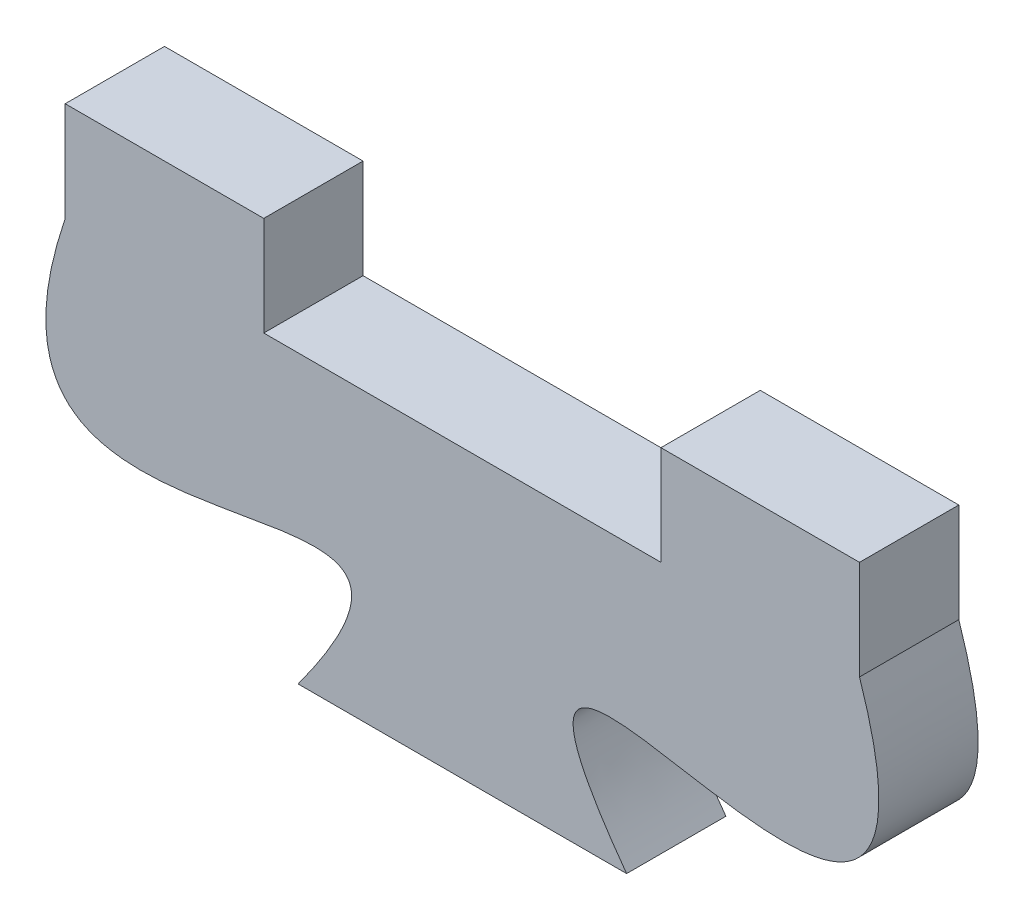
ISO-10303-21;
HEADER;
FILE_DESCRIPTION(('STEP AP214'),'2;1');
FILE_NAME('part.step','',(''),(''),'','','');
FILE_SCHEMA(('AUTOMOTIVE_DESIGN { 1 0 10303 214 1 1 1 1 }'));
ENDSEC;
DATA;
#1=APPLICATION_CONTEXT('core data for automotive mechanical design processes');
#2=APPLICATION_PROTOCOL_DEFINITION('international standard','automotive_design',2000,#1);
#3=PRODUCT_CONTEXT('',#1,'mechanical');
#4=PRODUCT('Part','Part','',(#3));
#5=PRODUCT_RELATED_PRODUCT_CATEGORY('part','',(#4));
#6=PRODUCT_DEFINITION_FORMATION('','',#4);
#7=PRODUCT_DEFINITION_CONTEXT('part definition',#1,'design');
#8=PRODUCT_DEFINITION('design','',#6,#7);
#9=PRODUCT_DEFINITION_SHAPE('','',#8);
#10=(LENGTH_UNIT() NAMED_UNIT(*) SI_UNIT(.MILLI.,.METRE.));
#11=(NAMED_UNIT(*) PLANE_ANGLE_UNIT() SI_UNIT($,.RADIAN.));
#12=(NAMED_UNIT(*) SI_UNIT($,.STERADIAN.) SOLID_ANGLE_UNIT());
#13=UNCERTAINTY_MEASURE_WITH_UNIT(LENGTH_MEASURE(1.E-05),#10,'distance_accuracy_value','');
#14=(GEOMETRIC_REPRESENTATION_CONTEXT(3) GLOBAL_UNCERTAINTY_ASSIGNED_CONTEXT((#13)) GLOBAL_UNIT_ASSIGNED_CONTEXT((#10,
#11,#12)) REPRESENTATION_CONTEXT('',''));
#15=CARTESIAN_POINT('',(0.,0.,0.));
#16=DIRECTION('',(0.,0.,1.));
#17=DIRECTION('',(1.,0.,0.));
#18=AXIS2_PLACEMENT_3D('',#15,#16,#17);
#19=CARTESIAN_POINT('',(-66.5721500795058,0.,3.175));
#20=DIRECTION('',(-1.,0.,0.));
#21=DIRECTION('',(0.,0.,1.));
#22=AXIS2_PLACEMENT_3D('',#19,#20,#21);
#23=PLANE('',#22);
#24=DIRECTION('',(0.,1.,0.));
#25=VECTOR('',#24,1.);
#26=CARTESIAN_POINT('',(-66.5721500795058,0.,0.));
#27=LINE('',#26,#25);
#28=CARTESIAN_POINT('',(-66.5721500795058,32.1944331283129,0.));
#29=VERTEX_POINT('',#28);
#30=CARTESIAN_POINT('',(-66.5721500795058,35.3694331283129,0.));
#31=VERTEX_POINT('',#30);
#32=EDGE_CURVE('E142',#29,#31,#27,.T.);
#33=ORIENTED_EDGE('',*,*,#32,.F.);
#34=DIRECTION('',(0.,0.,-1.));
#35=VECTOR('',#34,1.);
#36=CARTESIAN_POINT('',(-66.5721500795058,32.1944331283129,3.175));
#37=LINE('',#36,#35);
#38=CARTESIAN_POINT('',(-66.5721500795058,32.1944331283129,3.175));
#39=VERTEX_POINT('',#38);
#40=EDGE_CURVE('E11',#39,#29,#37,.T.);
#41=ORIENTED_EDGE('',*,*,#40,.F.);
#42=DIRECTION('',(0.,1.,0.));
#43=VECTOR('',#42,1.);
#44=CARTESIAN_POINT('',(-66.5721500795058,0.,3.175));
#45=LINE('',#44,#43);
#46=CARTESIAN_POINT('',(-66.5721500795058,35.3694331283129,3.175));
#47=VERTEX_POINT('',#46);
#48=EDGE_CURVE('E177',#39,#47,#45,.T.);
#49=ORIENTED_EDGE('',*,*,#48,.T.);
#50=DIRECTION('',(0.,0.,-1.));
#51=VECTOR('',#50,1.);
#52=CARTESIAN_POINT('',(-66.5721500795058,35.3694331283129,3.175));
#53=LINE('',#52,#51);
#54=EDGE_CURVE('E51',#47,#31,#53,.T.);
#55=ORIENTED_EDGE('',*,*,#54,.T.);
#56=EDGE_LOOP('',(#33,#41,#49,#55));
#57=FACE_BOUND('',#56,.T.);
#58=ADVANCED_FACE('F35',(#57),#23,.T.);
#59=CARTESIAN_POINT('',(-66.5721500795058,32.1944331283129,3.175));
#60=CARTESIAN_POINT('',(-70.7961120313766,19.6101925252432,3.175));
#61=CARTESIAN_POINT('',(-51.7665034842543,33.1167018138156,3.175));
#62=CARTESIAN_POINT('',(-59.1245975767005,23.0250331283129,3.175));
#63=B_SPLINE_CURVE_WITH_KNOTS('',3,(#59,#60,#61,#62),.UNSPECIFIED.,.F.,.F.,(4,4),(0.,1.),.UNSPECIFIED.);
#64=DIRECTION('',(0.,0.,-1.));
#65=VECTOR('',#64,1.);
#66=SURFACE_OF_LINEAR_EXTRUSION('',#63,#65);
#67=CARTESIAN_POINT('',(-66.5721500795058,32.1944331283129,0.));
#68=CARTESIAN_POINT('',(-70.7961120313766,19.6101925252432,0.));
#69=CARTESIAN_POINT('',(-51.7665034842543,33.1167018138156,0.));
#70=CARTESIAN_POINT('',(-59.1245975767005,23.0250331283129,0.));
#71=B_SPLINE_CURVE_WITH_KNOTS('',3,(#67,#68,#69,#70),.UNSPECIFIED.,.F.,.F.,(4,4),(0.,1.),.UNSPECIFIED.);
#72=CARTESIAN_POINT('',(-59.1245975767005,23.0250331283129,0.));
#73=VERTEX_POINT('',#72);
#74=EDGE_CURVE('E144',#29,#73,#71,.T.);
#75=ORIENTED_EDGE('',*,*,#74,.T.);
#76=DIRECTION('',(0.,0.,-1.));
#77=VECTOR('',#76,1.);
#78=CARTESIAN_POINT('',(-59.1245975767005,23.0250331283129,3.175));
#79=LINE('',#78,#77);
#80=CARTESIAN_POINT('',(-59.1245975767005,23.0250331283129,3.175));
#81=VERTEX_POINT('',#80);
#82=EDGE_CURVE('E43',#81,#73,#79,.T.);
#83=ORIENTED_EDGE('',*,*,#82,.F.);
#84=EDGE_CURVE('E210',#39,#81,#63,.T.);
#85=ORIENTED_EDGE('',*,*,#84,.F.);
#86=ORIENTED_EDGE('',*,*,#40,.T.);
#87=EDGE_LOOP('',(#75,#83,#85,#86));
#88=FACE_BOUND('',#87,.T.);
#89=ADVANCED_FACE('F198',(#88),#66,.F.);
#90=CARTESIAN_POINT('',(0.,23.0250331283129,3.175));
#91=DIRECTION('',(0.,-1.,0.));
#92=DIRECTION('',(0.,0.,-1.));
#93=AXIS2_PLACEMENT_3D('',#90,#91,#92);
#94=PLANE('',#93);
#95=DIRECTION('',(-1.,0.,0.));
#96=VECTOR('',#95,1.);
#97=CARTESIAN_POINT('',(0.,23.0250331283129,0.));
#98=LINE('',#97,#96);
#99=CARTESIAN_POINT('',(-48.6197025823112,23.0250331283129,0.));
#100=VERTEX_POINT('',#99);
#101=EDGE_CURVE('E149',#100,#73,#98,.T.);
#102=ORIENTED_EDGE('',*,*,#101,.F.);
#103=DIRECTION('',(0.,0.,-1.));
#104=VECTOR('',#103,1.);
#105=CARTESIAN_POINT('',(-48.6197025823112,23.0250331283129,3.175));
#106=LINE('',#105,#104);
#107=CARTESIAN_POINT('',(-48.6197025823112,23.0250331283129,3.175));
#108=VERTEX_POINT('',#107);
#109=EDGE_CURVE('E188',#108,#100,#106,.T.);
#110=ORIENTED_EDGE('',*,*,#109,.F.);
#111=DIRECTION('',(-1.,0.,0.));
#112=VECTOR('',#111,1.);
#113=CARTESIAN_POINT('',(0.,23.0250331283129,3.175));
#114=LINE('',#113,#112);
#115=EDGE_CURVE('E195',#108,#81,#114,.T.);
#116=ORIENTED_EDGE('',*,*,#115,.T.);
#117=ORIENTED_EDGE('',*,*,#82,.T.);
#118=EDGE_LOOP('',(#102,#110,#116,#117));
#119=FACE_BOUND('',#118,.T.);
#120=ADVANCED_FACE('F193',(#119),#94,.T.);
#121=CARTESIAN_POINT('',(-41.1721500795058,32.1944331283129,3.175));
#122=CARTESIAN_POINT('',(-36.9481881276352,19.6101925252431,3.175));
#123=CARTESIAN_POINT('',(-55.9777966747574,33.1167018138157,3.175));
#124=CARTESIAN_POINT('',(-48.6197025823112,23.0250331283129,3.175));
#125=B_SPLINE_CURVE_WITH_KNOTS('',3,(#121,#122,#123,#124),.UNSPECIFIED.,.F.,.F.,(4,4),(0.,1.),.UNSPECIFIED.);
#126=DIRECTION('',(0.,0.,-1.));
#127=VECTOR('',#126,1.);
#128=SURFACE_OF_LINEAR_EXTRUSION('',#125,#127);
#129=CARTESIAN_POINT('',(-41.1721500795058,32.1944331283129,0.));
#130=CARTESIAN_POINT('',(-36.9481881276352,19.6101925252431,0.));
#131=CARTESIAN_POINT('',(-55.9777966747574,33.1167018138157,0.));
#132=CARTESIAN_POINT('',(-48.6197025823112,23.0250331283129,0.));
#133=B_SPLINE_CURVE_WITH_KNOTS('',3,(#129,#130,#131,#132),.UNSPECIFIED.,.F.,.F.,(4,4),(0.,1.),.UNSPECIFIED.);
#134=CARTESIAN_POINT('',(-41.1721500795058,32.1944331283129,0.));
#135=VERTEX_POINT('',#134);
#136=EDGE_CURVE('E155',#135,#100,#133,.T.);
#137=ORIENTED_EDGE('',*,*,#136,.F.);
#138=DIRECTION('',(0.,0.,-1.));
#139=VECTOR('',#138,1.);
#140=CARTESIAN_POINT('',(-41.1721500795058,32.1944331283129,3.175));
#141=LINE('',#140,#139);
#142=CARTESIAN_POINT('',(-41.1721500795058,32.1944331283129,3.175));
#143=VERTEX_POINT('',#142);
#144=EDGE_CURVE('E186',#143,#135,#141,.T.);
#145=ORIENTED_EDGE('',*,*,#144,.F.);
#146=EDGE_CURVE('E209',#143,#108,#125,.T.);
#147=ORIENTED_EDGE('',*,*,#146,.T.);
#148=ORIENTED_EDGE('',*,*,#109,.T.);
#149=EDGE_LOOP('',(#137,#145,#147,#148));
#150=FACE_BOUND('',#149,.T.);
#151=ADVANCED_FACE('F205',(#150),#128,.T.);
#152=CARTESIAN_POINT('',(-41.1721500795058,0.,3.175));
#153=DIRECTION('',(-1.,0.,0.));
#154=DIRECTION('',(0.,0.,1.));
#155=AXIS2_PLACEMENT_3D('',#152,#153,#154);
#156=PLANE('',#155);
#157=DIRECTION('',(0.,1.,0.));
#158=VECTOR('',#157,1.);
#159=CARTESIAN_POINT('',(-41.1721500795058,0.,0.));
#160=LINE('',#159,#158);
#161=CARTESIAN_POINT('',(-41.1721500795058,35.3694331283129,0.));
#162=VERTEX_POINT('',#161);
#163=EDGE_CURVE('E160',#135,#162,#160,.T.);
#164=ORIENTED_EDGE('',*,*,#163,.T.);
#165=DIRECTION('',(0.,0.,-1.));
#166=VECTOR('',#165,1.);
#167=CARTESIAN_POINT('',(-41.1721500795058,35.3694331283129,3.175));
#168=LINE('',#167,#166);
#169=CARTESIAN_POINT('',(-41.1721500795058,35.3694331283129,3.175));
#170=VERTEX_POINT('',#169);
#171=EDGE_CURVE('E183',#170,#162,#168,.T.);
#172=ORIENTED_EDGE('',*,*,#171,.F.);
#173=DIRECTION('',(0.,1.,0.));
#174=VECTOR('',#173,1.);
#175=CARTESIAN_POINT('',(-41.1721500795058,0.,3.175));
#176=LINE('',#175,#174);
#177=EDGE_CURVE('E212',#143,#170,#176,.T.);
#178=ORIENTED_EDGE('',*,*,#177,.F.);
#179=ORIENTED_EDGE('',*,*,#144,.T.);
#180=EDGE_LOOP('',(#164,#172,#178,#179));
#181=FACE_BOUND('',#180,.T.);
#182=ADVANCED_FACE('F230',(#181),#156,.F.);
#183=CARTESIAN_POINT('',(0.,35.3694331283129,3.175));
#184=DIRECTION('',(0.,-1.,0.));
#185=DIRECTION('',(0.,0.,-1.));
#186=AXIS2_PLACEMENT_3D('',#183,#184,#185);
#187=PLANE('',#186);
#188=DIRECTION('',(-1.,0.,0.));
#189=VECTOR('',#188,1.);
#190=CARTESIAN_POINT('',(0.,35.3694331283129,0.));
#191=LINE('',#190,#189);
#192=CARTESIAN_POINT('',(-47.5221500795058,35.3694331283129,0.));
#193=VERTEX_POINT('',#192);
#194=EDGE_CURVE('E165',#162,#193,#191,.T.);
#195=ORIENTED_EDGE('',*,*,#194,.T.);
#196=DIRECTION('',(0.,0.,-1.));
#197=VECTOR('',#196,1.);
#198=CARTESIAN_POINT('',(-47.5221500795058,35.3694331283129,3.175));
#199=LINE('',#198,#197);
#200=CARTESIAN_POINT('',(-47.5221500795058,35.3694331283129,3.175));
#201=VERTEX_POINT('',#200);
#202=EDGE_CURVE('E181',#201,#193,#199,.T.);
#203=ORIENTED_EDGE('',*,*,#202,.F.);
#204=DIRECTION('',(-1.,0.,0.));
#205=VECTOR('',#204,1.);
#206=CARTESIAN_POINT('',(0.,35.3694331283129,3.175));
#207=LINE('',#206,#205);
#208=EDGE_CURVE('E137',#170,#201,#207,.T.);
#209=ORIENTED_EDGE('',*,*,#208,.F.);
#210=ORIENTED_EDGE('',*,*,#171,.T.);
#211=EDGE_LOOP('',(#195,#203,#209,#210));
#212=FACE_BOUND('',#211,.T.);
#213=ADVANCED_FACE('F254',(#212),#187,.F.);
#214=CARTESIAN_POINT('',(-47.5221500795058,0.,3.175));
#215=DIRECTION('',(-1.,0.,0.));
#216=DIRECTION('',(0.,0.,1.));
#217=AXIS2_PLACEMENT_3D('',#214,#215,#216);
#218=PLANE('',#217);
#219=DIRECTION('',(0.,1.,0.));
#220=VECTOR('',#219,1.);
#221=CARTESIAN_POINT('',(-47.5221500795058,0.,0.));
#222=LINE('',#221,#220);
#223=CARTESIAN_POINT('',(-47.5221500795058,32.1944331283129,0.));
#224=VERTEX_POINT('',#223);
#225=EDGE_CURVE('E168',#224,#193,#222,.T.);
#226=ORIENTED_EDGE('',*,*,#225,.F.);
#227=DIRECTION('',(0.,0.,-1.));
#228=VECTOR('',#227,1.);
#229=CARTESIAN_POINT('',(-47.5221500795058,32.1944331283129,3.175));
#230=LINE('',#229,#228);
#231=CARTESIAN_POINT('',(-47.5221500795058,32.1944331283129,3.175));
#232=VERTEX_POINT('',#231);
#233=EDGE_CURVE('E123',#232,#224,#230,.T.);
#234=ORIENTED_EDGE('',*,*,#233,.F.);
#235=DIRECTION('',(0.,1.,0.));
#236=VECTOR('',#235,1.);
#237=CARTESIAN_POINT('',(-47.5221500795058,0.,3.175));
#238=LINE('',#237,#236);
#239=EDGE_CURVE('E135',#232,#201,#238,.T.);
#240=ORIENTED_EDGE('',*,*,#239,.T.);
#241=ORIENTED_EDGE('',*,*,#202,.T.);
#242=EDGE_LOOP('',(#226,#234,#240,#241));
#243=FACE_BOUND('',#242,.T.);
#244=ADVANCED_FACE('F252',(#243),#218,.T.);
#245=CARTESIAN_POINT('',(0.,32.1944331283129,3.175));
#246=DIRECTION('',(0.,1.,0.));
#247=DIRECTION('',(0.,0.,1.));
#248=AXIS2_PLACEMENT_3D('',#245,#246,#247);
#249=PLANE('',#248);
#250=DIRECTION('',(1.,0.,0.));
#251=VECTOR('',#250,1.);
#252=CARTESIAN_POINT('',(0.,32.1944331283129,0.));
#253=LINE('',#252,#251);
#254=CARTESIAN_POINT('',(-60.2221500795058,32.1944331283129,0.));
#255=VERTEX_POINT('',#254);
#256=EDGE_CURVE('E120',#255,#224,#253,.T.);
#257=ORIENTED_EDGE('',*,*,#256,.F.);
#258=DIRECTION('',(0.,0.,-1.));
#259=VECTOR('',#258,1.);
#260=CARTESIAN_POINT('',(-60.2221500795058,32.1944331283129,3.175));
#261=LINE('',#260,#259);
#262=CARTESIAN_POINT('',(-60.2221500795058,32.1944331283129,3.175));
#263=VERTEX_POINT('',#262);
#264=EDGE_CURVE('E114',#263,#255,#261,.T.);
#265=ORIENTED_EDGE('',*,*,#264,.F.);
#266=DIRECTION('',(1.,0.,0.));
#267=VECTOR('',#266,1.);
#268=CARTESIAN_POINT('',(0.,32.1944331283129,3.175));
#269=LINE('',#268,#267);
#270=EDGE_CURVE('E118',#263,#232,#269,.T.);
#271=ORIENTED_EDGE('',*,*,#270,.T.);
#272=ORIENTED_EDGE('',*,*,#233,.T.);
#273=EDGE_LOOP('',(#257,#265,#271,#272));
#274=FACE_BOUND('',#273,.T.);
#275=ADVANCED_FACE('F116',(#274),#249,.T.);
#276=CARTESIAN_POINT('',(-60.2221500795058,0.,3.175));
#277=DIRECTION('',(-1.,0.,0.));
#278=DIRECTION('',(0.,0.,1.));
#279=AXIS2_PLACEMENT_3D('',#276,#277,#278);
#280=PLANE('',#279);
#281=DIRECTION('',(0.,1.,0.));
#282=VECTOR('',#281,1.);
#283=CARTESIAN_POINT('',(-60.2221500795058,0.,0.));
#284=LINE('',#283,#282);
#285=CARTESIAN_POINT('',(-60.2221500795058,35.3694331283129,0.));
#286=VERTEX_POINT('',#285);
#287=EDGE_CURVE('E172',#255,#286,#284,.T.);
#288=ORIENTED_EDGE('',*,*,#287,.T.);
#289=DIRECTION('',(0.,0.,-1.));
#290=VECTOR('',#289,1.);
#291=CARTESIAN_POINT('',(-60.2221500795058,35.3694331283129,3.175));
#292=LINE('',#291,#290);
#293=CARTESIAN_POINT('',(-60.2221500795058,35.3694331283129,3.175));
#294=VERTEX_POINT('',#293);
#295=EDGE_CURVE('E83',#294,#286,#292,.T.);
#296=ORIENTED_EDGE('',*,*,#295,.F.);
#297=DIRECTION('',(0.,1.,0.));
#298=VECTOR('',#297,1.);
#299=CARTESIAN_POINT('',(-60.2221500795058,0.,3.175));
#300=LINE('',#299,#298);
#301=EDGE_CURVE('E125',#263,#294,#300,.T.);
#302=ORIENTED_EDGE('',*,*,#301,.F.);
#303=ORIENTED_EDGE('',*,*,#264,.T.);
#304=EDGE_LOOP('',(#288,#296,#302,#303));
#305=FACE_BOUND('',#304,.T.);
#306=ADVANCED_FACE('F126',(#305),#280,.F.);
#307=CARTESIAN_POINT('',(0.,35.3694331283129,3.175));
#308=DIRECTION('',(0.,1.,0.));
#309=DIRECTION('',(0.,0.,1.));
#310=AXIS2_PLACEMENT_3D('',#307,#308,#309);
#311=PLANE('',#310);
#312=DIRECTION('',(1.,0.,0.));
#313=VECTOR('',#312,1.);
#314=CARTESIAN_POINT('',(0.,35.3694331283129,0.));
#315=LINE('',#314,#313);
#316=EDGE_CURVE('E174',#31,#286,#315,.T.);
#317=ORIENTED_EDGE('',*,*,#316,.F.);
#318=ORIENTED_EDGE('',*,*,#54,.F.);
#319=DIRECTION('',(1.,0.,0.));
#320=VECTOR('',#319,1.);
#321=CARTESIAN_POINT('',(0.,35.3694331283129,3.175));
#322=LINE('',#321,#320);
#323=EDGE_CURVE('E129',#47,#294,#322,.T.);
#324=ORIENTED_EDGE('',*,*,#323,.T.);
#325=ORIENTED_EDGE('',*,*,#295,.T.);
#326=EDGE_LOOP('',(#317,#318,#324,#325));
#327=FACE_BOUND('',#326,.T.);
#328=ADVANCED_FACE('F239',(#327),#311,.T.);
#329=CARTESIAN_POINT('',(0.,0.,3.175));
#330=DIRECTION('',(0.,0.,1.));
#331=DIRECTION('',(1.,0.,0.));
#332=AXIS2_PLACEMENT_3D('',#329,#330,#331);
#333=PLANE('',#332);
#334=ORIENTED_EDGE('',*,*,#48,.F.);
#335=ORIENTED_EDGE('',*,*,#84,.T.);
#336=ORIENTED_EDGE('',*,*,#115,.F.);
#337=ORIENTED_EDGE('',*,*,#146,.F.);
#338=ORIENTED_EDGE('',*,*,#177,.T.);
#339=ORIENTED_EDGE('',*,*,#208,.T.);
#340=ORIENTED_EDGE('',*,*,#239,.F.);
#341=ORIENTED_EDGE('',*,*,#270,.F.);
#342=ORIENTED_EDGE('',*,*,#301,.T.);
#343=ORIENTED_EDGE('',*,*,#323,.F.);
#344=EDGE_LOOP('',(#334,#335,#336,#337,#338,#339,#340,#341,#342,#343));
#345=FACE_BOUND('',#344,.T.);
#346=ADVANCED_FACE('F133',(#345),#333,.T.);
#347=CARTESIAN_POINT('',(0.,0.,0.));
#348=DIRECTION('',(0.,0.,1.));
#349=DIRECTION('',(1.,0.,0.));
#350=AXIS2_PLACEMENT_3D('',#347,#348,#349);
#351=PLANE('',#350);
#352=ORIENTED_EDGE('',*,*,#32,.T.);
#353=ORIENTED_EDGE('',*,*,#316,.T.);
#354=ORIENTED_EDGE('',*,*,#287,.F.);
#355=ORIENTED_EDGE('',*,*,#256,.T.);
#356=ORIENTED_EDGE('',*,*,#225,.T.);
#357=ORIENTED_EDGE('',*,*,#194,.F.);
#358=ORIENTED_EDGE('',*,*,#163,.F.);
#359=ORIENTED_EDGE('',*,*,#136,.T.);
#360=ORIENTED_EDGE('',*,*,#101,.T.);
#361=ORIENTED_EDGE('',*,*,#74,.F.);
#362=EDGE_LOOP('',(#352,#353,#354,#355,#356,#357,#358,#359,#360,#361));
#363=FACE_BOUND('',#362,.T.);
#364=ADVANCED_FACE('F200',(#363),#351,.F.);
#365=CLOSED_SHELL('',(#58,#89,#120,#151,#182,#213,#244,#275,#306,#328,#346,#364));
#366=MANIFOLD_SOLID_BREP('B2',#365);
#367=ADVANCED_BREP_SHAPE_REPRESENTATION('',(#18,#366),#14);
#368=SHAPE_DEFINITION_REPRESENTATION(#9,#367);
ENDSEC;
END-ISO-10303-21;
